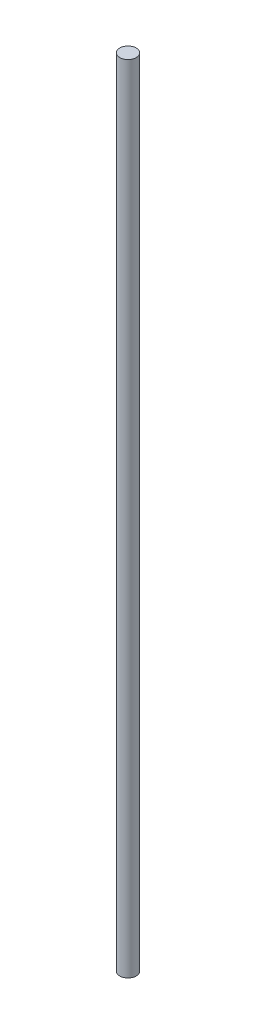
ISO-10303-21;
HEADER;
FILE_DESCRIPTION(('STEP AP214'),'2;1');
FILE_NAME('part.step','',(''),(''),'','','');
FILE_SCHEMA(('AUTOMOTIVE_DESIGN { 1 0 10303 214 1 1 1 1 }'));
ENDSEC;
DATA;
#1=APPLICATION_CONTEXT('core data for automotive mechanical design processes');
#2=APPLICATION_PROTOCOL_DEFINITION('international standard','automotive_design',2000,#1);
#3=PRODUCT_CONTEXT('',#1,'mechanical');
#4=PRODUCT('Part','Part','',(#3));
#5=PRODUCT_RELATED_PRODUCT_CATEGORY('part','',(#4));
#6=PRODUCT_DEFINITION_FORMATION('','',#4);
#7=PRODUCT_DEFINITION_CONTEXT('part definition',#1,'design');
#8=PRODUCT_DEFINITION('design','',#6,#7);
#9=PRODUCT_DEFINITION_SHAPE('','',#8);
#10=(LENGTH_UNIT() NAMED_UNIT(*) SI_UNIT(.MILLI.,.METRE.));
#11=(NAMED_UNIT(*) PLANE_ANGLE_UNIT() SI_UNIT($,.RADIAN.));
#12=(NAMED_UNIT(*) SI_UNIT($,.STERADIAN.) SOLID_ANGLE_UNIT());
#13=UNCERTAINTY_MEASURE_WITH_UNIT(LENGTH_MEASURE(1.E-05),#10,'distance_accuracy_value','');
#14=(GEOMETRIC_REPRESENTATION_CONTEXT(3) GLOBAL_UNCERTAINTY_ASSIGNED_CONTEXT((#13)) GLOBAL_UNIT_ASSIGNED_CONTEXT((#10,
#11,#12)) REPRESENTATION_CONTEXT('',''));
#15=CARTESIAN_POINT('',(0.,0.,0.));
#16=DIRECTION('',(0.,0.,1.));
#17=DIRECTION('',(1.,0.,0.));
#18=AXIS2_PLACEMENT_3D('',#15,#16,#17);
#19=CARTESIAN_POINT('',(0.,304.8,0.));
#20=DIRECTION('',(0.,-1.,0.));
#21=DIRECTION('',(0.,0.,-1.));
#22=AXIS2_PLACEMENT_3D('',#19,#20,#21);
#23=CYLINDRICAL_SURFACE('',#22,3.175);
#24=CARTESIAN_POINT('',(0.,304.8,0.));
#25=DIRECTION('',(0.,1.,0.));
#26=DIRECTION('',(0.,0.,1.));
#27=AXIS2_PLACEMENT_3D('',#24,#25,#26);
#28=CIRCLE('',#27,3.175);
#29=CARTESIAN_POINT('',(0.,304.8,3.175));
#30=VERTEX_POINT('',#29);
#31=EDGE_CURVE('E10',#30,#30,#28,.T.);
#32=ORIENTED_EDGE('',*,*,#31,.F.);
#33=EDGE_LOOP('',(#32));
#34=FACE_BOUND('',#33,.T.);
#35=CARTESIAN_POINT('',(0.,0.,0.));
#36=DIRECTION('',(0.,1.,0.));
#37=DIRECTION('',(0.,0.,1.));
#38=AXIS2_PLACEMENT_3D('',#35,#36,#37);
#39=CIRCLE('',#38,3.175);
#40=CARTESIAN_POINT('',(0.,0.,3.175));
#41=VERTEX_POINT('',#40);
#42=EDGE_CURVE('E34',#41,#41,#39,.T.);
#43=ORIENTED_EDGE('',*,*,#42,.T.);
#44=EDGE_LOOP('',(#43));
#45=FACE_BOUND('',#44,.T.);
#46=ADVANCED_FACE('F31',(#34,#45),#23,.T.);
#47=CARTESIAN_POINT('',(0.,304.8,0.));
#48=DIRECTION('',(0.,1.,0.));
#49=DIRECTION('',(0.,0.,1.));
#50=AXIS2_PLACEMENT_3D('',#47,#48,#49);
#51=PLANE('',#50);
#52=ORIENTED_EDGE('',*,*,#31,.T.);
#53=EDGE_LOOP('',(#52));
#54=FACE_BOUND('',#53,.T.);
#55=ADVANCED_FACE('F46',(#54),#51,.T.);
#56=CARTESIAN_POINT('',(0.,0.,0.));
#57=DIRECTION('',(0.,1.,0.));
#58=DIRECTION('',(0.,0.,1.));
#59=AXIS2_PLACEMENT_3D('',#56,#57,#58);
#60=PLANE('',#59);
#61=ORIENTED_EDGE('',*,*,#42,.F.);
#62=EDGE_LOOP('',(#61));
#63=FACE_BOUND('',#62,.T.);
#64=ADVANCED_FACE('F44',(#63),#60,.F.);
#65=CLOSED_SHELL('',(#46,#55,#64));
#66=MANIFOLD_SOLID_BREP('B2',#65);
#67=ADVANCED_BREP_SHAPE_REPRESENTATION('',(#18,#66),#14);
#68=SHAPE_DEFINITION_REPRESENTATION(#9,#67);
ENDSEC;
END-ISO-10303-21;
